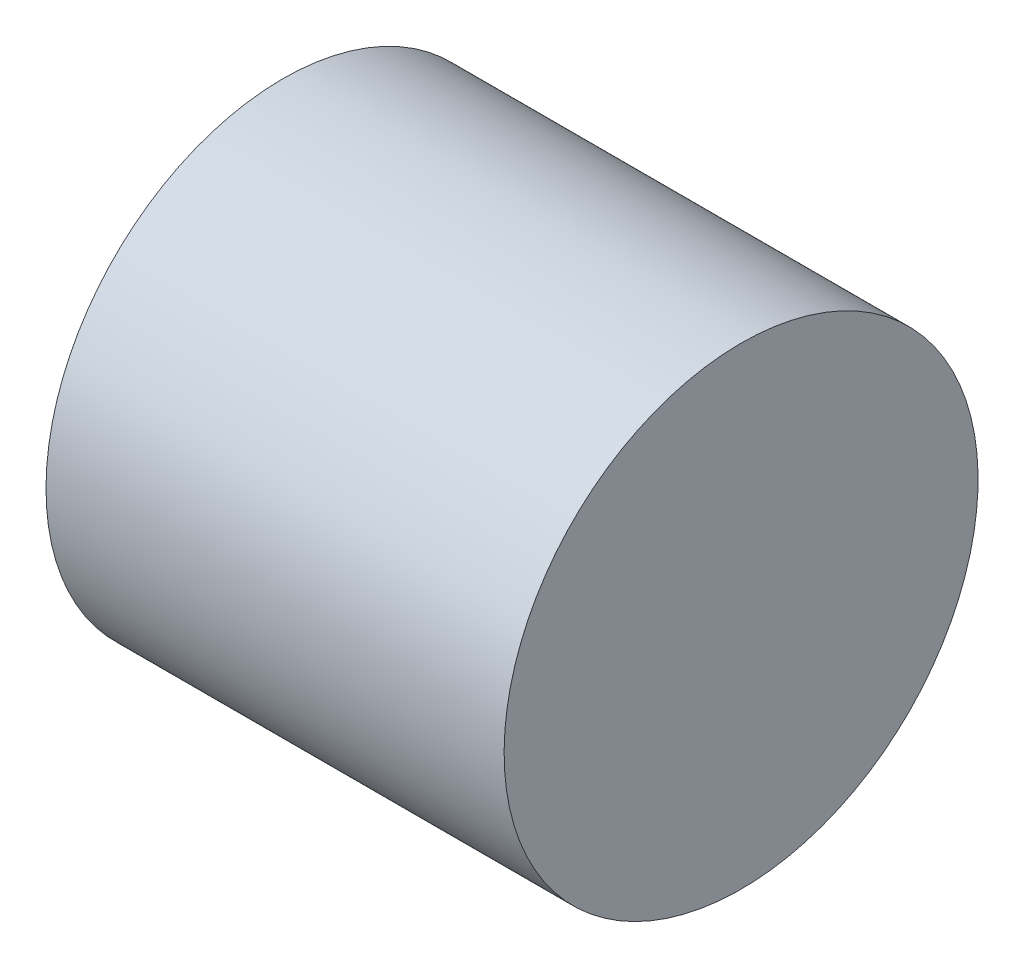
ISO-10303-21;
HEADER;
FILE_DESCRIPTION(('STEP AP214'),'2;1');
FILE_NAME('part.step','',(''),(''),'','','');
FILE_SCHEMA(('AUTOMOTIVE_DESIGN { 1 0 10303 214 1 1 1 1 }'));
ENDSEC;
DATA;
#1=APPLICATION_CONTEXT('core data for automotive mechanical design processes');
#2=APPLICATION_PROTOCOL_DEFINITION('international standard','automotive_design',2000,#1);
#3=PRODUCT_CONTEXT('',#1,'mechanical');
#4=PRODUCT('Part','Part','',(#3));
#5=PRODUCT_RELATED_PRODUCT_CATEGORY('part','',(#4));
#6=PRODUCT_DEFINITION_FORMATION('','',#4);
#7=PRODUCT_DEFINITION_CONTEXT('part definition',#1,'design');
#8=PRODUCT_DEFINITION('design','',#6,#7);
#9=PRODUCT_DEFINITION_SHAPE('','',#8);
#10=(LENGTH_UNIT() NAMED_UNIT(*) SI_UNIT(.MILLI.,.METRE.));
#11=(NAMED_UNIT(*) PLANE_ANGLE_UNIT() SI_UNIT($,.RADIAN.));
#12=(NAMED_UNIT(*) SI_UNIT($,.STERADIAN.) SOLID_ANGLE_UNIT());
#13=UNCERTAINTY_MEASURE_WITH_UNIT(LENGTH_MEASURE(1.E-05),#10,'distance_accuracy_value','');
#14=(GEOMETRIC_REPRESENTATION_CONTEXT(3) GLOBAL_UNCERTAINTY_ASSIGNED_CONTEXT((#13)) GLOBAL_UNIT_ASSIGNED_CONTEXT((#10,
#11,#12)) REPRESENTATION_CONTEXT('',''));
#15=CARTESIAN_POINT('',(0.,0.,0.));
#16=DIRECTION('',(0.,0.,1.));
#17=DIRECTION('',(1.,0.,0.));
#18=AXIS2_PLACEMENT_3D('',#15,#16,#17);
#19=CARTESIAN_POINT('',(88.9,0.,0.));
#20=DIRECTION('',(1.,0.,0.));
#21=DIRECTION('',(0.,0.023802777946289,-0.999716673744136));
#22=AXIS2_PLACEMENT_3D('',#19,#20,#21);
#23=ELLIPSE('',#22,45.9866324985437,45.8910984178102);
#24=DIRECTION('',(-1.,0.,0.));
#25=VECTOR('',#24,1.);
#26=SURFACE_OF_LINEAR_EXTRUSION('',#23,#25);
#27=CARTESIAN_POINT('',(88.9,1.09460960186043,-45.9736032781381));
#28=VERTEX_POINT('',#27);
#29=EDGE_CURVE('E10',#28,#28,#23,.T.);
#30=ORIENTED_EDGE('',*,*,#29,.F.);
#31=EDGE_LOOP('',(#30));
#32=FACE_BOUND('',#31,.T.);
#33=CARTESIAN_POINT('',(0.,0.,0.));
#34=DIRECTION('',(1.,0.,0.));
#35=DIRECTION('',(0.,0.023802777946289,-0.999716673744136));
#36=AXIS2_PLACEMENT_3D('',#33,#34,#35);
#37=ELLIPSE('',#36,45.9866324985437,45.8910984178102);
#38=CARTESIAN_POINT('',(0.,1.09460960186043,-45.9736032781381));
#39=VERTEX_POINT('',#38);
#40=EDGE_CURVE('E41',#39,#39,#37,.T.);
#41=ORIENTED_EDGE('',*,*,#40,.T.);
#42=EDGE_LOOP('',(#41));
#43=FACE_BOUND('',#42,.T.);
#44=ADVANCED_FACE('F37',(#32,#43),#26,.F.);
#45=CARTESIAN_POINT('',(88.9,0.,0.));
#46=DIRECTION('',(1.,0.,0.));
#47=DIRECTION('',(0.,0.,-1.));
#48=AXIS2_PLACEMENT_3D('',#45,#46,#47);
#49=PLANE('',#48);
#50=ORIENTED_EDGE('',*,*,#29,.T.);
#51=EDGE_LOOP('',(#50));
#52=FACE_BOUND('',#51,.T.);
#53=ADVANCED_FACE('F53',(#52),#49,.T.);
#54=CARTESIAN_POINT('',(0.,0.,0.));
#55=DIRECTION('',(1.,0.,0.));
#56=DIRECTION('',(0.,0.,-1.));
#57=AXIS2_PLACEMENT_3D('',#54,#55,#56);
#58=PLANE('',#57);
#59=ORIENTED_EDGE('',*,*,#40,.F.);
#60=EDGE_LOOP('',(#59));
#61=FACE_BOUND('',#60,.T.);
#62=ADVANCED_FACE('F51',(#61),#58,.F.);
#63=CLOSED_SHELL('',(#44,#53,#62));
#64=MANIFOLD_SOLID_BREP('B2',#63);
#65=ADVANCED_BREP_SHAPE_REPRESENTATION('',(#18,#64),#14);
#66=SHAPE_DEFINITION_REPRESENTATION(#9,#65);
ENDSEC;
END-ISO-10303-21;
